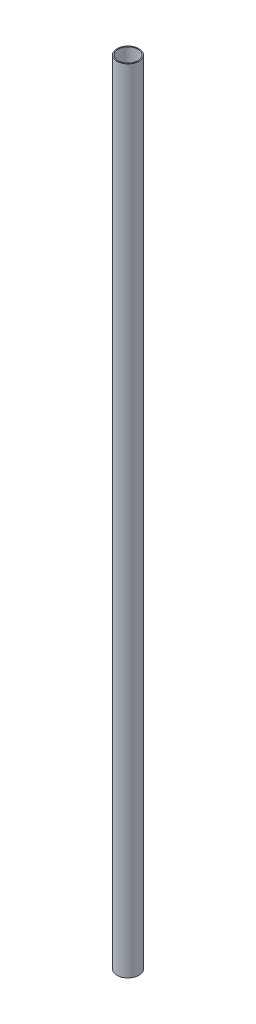
ISO-10303-21;
HEADER;
FILE_DESCRIPTION(('STEP AP214'),'2;1');
FILE_NAME('part.step','',(''),(''),'','','');
FILE_SCHEMA(('AUTOMOTIVE_DESIGN { 1 0 10303 214 1 1 1 1 }'));
ENDSEC;
DATA;
#1=APPLICATION_CONTEXT('core data for automotive mechanical design processes');
#2=APPLICATION_PROTOCOL_DEFINITION('international standard','automotive_design',2000,#1);
#3=PRODUCT_CONTEXT('',#1,'mechanical');
#4=PRODUCT('Part','Part','',(#3));
#5=PRODUCT_RELATED_PRODUCT_CATEGORY('part','',(#4));
#6=PRODUCT_DEFINITION_FORMATION('','',#4);
#7=PRODUCT_DEFINITION_CONTEXT('part definition',#1,'design');
#8=PRODUCT_DEFINITION('design','',#6,#7);
#9=PRODUCT_DEFINITION_SHAPE('','',#8);
#10=(LENGTH_UNIT() NAMED_UNIT(*) SI_UNIT(.MILLI.,.METRE.));
#11=(NAMED_UNIT(*) PLANE_ANGLE_UNIT() SI_UNIT($,.RADIAN.));
#12=(NAMED_UNIT(*) SI_UNIT($,.STERADIAN.) SOLID_ANGLE_UNIT());
#13=UNCERTAINTY_MEASURE_WITH_UNIT(LENGTH_MEASURE(1.E-05),#10,'distance_accuracy_value','');
#14=(GEOMETRIC_REPRESENTATION_CONTEXT(3) GLOBAL_UNCERTAINTY_ASSIGNED_CONTEXT((#13)) GLOBAL_UNIT_ASSIGNED_CONTEXT((#10,
#11,#12)) REPRESENTATION_CONTEXT('',''));
#15=CARTESIAN_POINT('',(0.,0.,0.));
#16=DIRECTION('',(0.,0.,1.));
#17=DIRECTION('',(1.,0.,0.));
#18=AXIS2_PLACEMENT_3D('',#15,#16,#17);
#19=CARTESIAN_POINT('',(0.,915.,0.));
#20=DIRECTION('',(0.,1.,0.));
#21=DIRECTION('',(0.,0.,1.));
#22=AXIS2_PLACEMENT_3D('',#19,#20,#21);
#23=PLANE('',#22);
#24=CARTESIAN_POINT('',(0.,915.,0.));
#25=DIRECTION('',(0.,1.,0.));
#26=DIRECTION('',(0.,0.,1.));
#27=AXIS2_PLACEMENT_3D('',#24,#25,#26);
#28=CIRCLE('',#27,12.7);
#29=CARTESIAN_POINT('',(0.,915.,12.7));
#30=VERTEX_POINT('',#29);
#31=EDGE_CURVE('E10',#30,#30,#28,.T.);
#32=ORIENTED_EDGE('',*,*,#31,.T.);
#33=EDGE_LOOP('',(#32));
#34=FACE_BOUND('',#33,.T.);
#35=CARTESIAN_POINT('',(0.,915.,0.));
#36=DIRECTION('',(0.,1.,0.));
#37=DIRECTION('',(0.,0.,1.));
#38=AXIS2_PLACEMENT_3D('',#35,#36,#37);
#39=CIRCLE('',#38,11.5);
#40=CARTESIAN_POINT('',(0.,915.,11.5));
#41=VERTEX_POINT('',#40);
#42=EDGE_CURVE('E50',#41,#41,#39,.T.);
#43=ORIENTED_EDGE('',*,*,#42,.F.);
#44=EDGE_LOOP('',(#43));
#45=FACE_BOUND('',#44,.T.);
#46=ADVANCED_FACE('F39',(#34,#45),#23,.T.);
#47=CARTESIAN_POINT('',(0.,0.,0.));
#48=DIRECTION('',(0.,1.,0.));
#49=DIRECTION('',(0.,0.,1.));
#50=AXIS2_PLACEMENT_3D('',#47,#48,#49);
#51=PLANE('',#50);
#52=CARTESIAN_POINT('',(0.,0.,0.));
#53=DIRECTION('',(0.,1.,0.));
#54=DIRECTION('',(0.,0.,1.));
#55=AXIS2_PLACEMENT_3D('',#52,#53,#54);
#56=CIRCLE('',#55,12.7);
#57=CARTESIAN_POINT('',(0.,0.,12.7));
#58=VERTEX_POINT('',#57);
#59=EDGE_CURVE('E43',#58,#58,#56,.T.);
#60=ORIENTED_EDGE('',*,*,#59,.F.);
#61=EDGE_LOOP('',(#60));
#62=FACE_BOUND('',#61,.T.);
#63=CARTESIAN_POINT('',(0.,0.,0.));
#64=DIRECTION('',(0.,1.,0.));
#65=DIRECTION('',(0.,0.,1.));
#66=AXIS2_PLACEMENT_3D('',#63,#64,#65);
#67=CIRCLE('',#66,11.5);
#68=CARTESIAN_POINT('',(0.,0.,11.5));
#69=VERTEX_POINT('',#68);
#70=EDGE_CURVE('E52',#69,#69,#67,.T.);
#71=ORIENTED_EDGE('',*,*,#70,.T.);
#72=EDGE_LOOP('',(#71));
#73=FACE_BOUND('',#72,.T.);
#74=ADVANCED_FACE('F62',(#62,#73),#51,.F.);
#75=CARTESIAN_POINT('',(0.,915.,0.));
#76=DIRECTION('',(0.,-1.,0.));
#77=DIRECTION('',(0.,0.,-1.));
#78=AXIS2_PLACEMENT_3D('',#75,#76,#77);
#79=CYLINDRICAL_SURFACE('',#78,12.7);
#80=ORIENTED_EDGE('',*,*,#31,.F.);
#81=EDGE_LOOP('',(#80));
#82=FACE_BOUND('',#81,.T.);
#83=ORIENTED_EDGE('',*,*,#59,.T.);
#84=EDGE_LOOP('',(#83));
#85=FACE_BOUND('',#84,.T.);
#86=ADVANCED_FACE('F41',(#82,#85),#79,.T.);
#87=CARTESIAN_POINT('',(0.,915.,0.));
#88=DIRECTION('',(0.,-1.,0.));
#89=DIRECTION('',(0.,0.,-1.));
#90=AXIS2_PLACEMENT_3D('',#87,#88,#89);
#91=CYLINDRICAL_SURFACE('',#90,11.5);
#92=ORIENTED_EDGE('',*,*,#42,.T.);
#93=EDGE_LOOP('',(#92));
#94=FACE_BOUND('',#93,.T.);
#95=ORIENTED_EDGE('',*,*,#70,.F.);
#96=EDGE_LOOP('',(#95));
#97=FACE_BOUND('',#96,.T.);
#98=ADVANCED_FACE('F58',(#94,#97),#91,.F.);
#99=CLOSED_SHELL('',(#46,#74,#86,#98));
#100=MANIFOLD_SOLID_BREP('B2',#99);
#101=ADVANCED_BREP_SHAPE_REPRESENTATION('',(#18,#100),#14);
#102=SHAPE_DEFINITION_REPRESENTATION(#9,#101);
ENDSEC;
END-ISO-10303-21;
